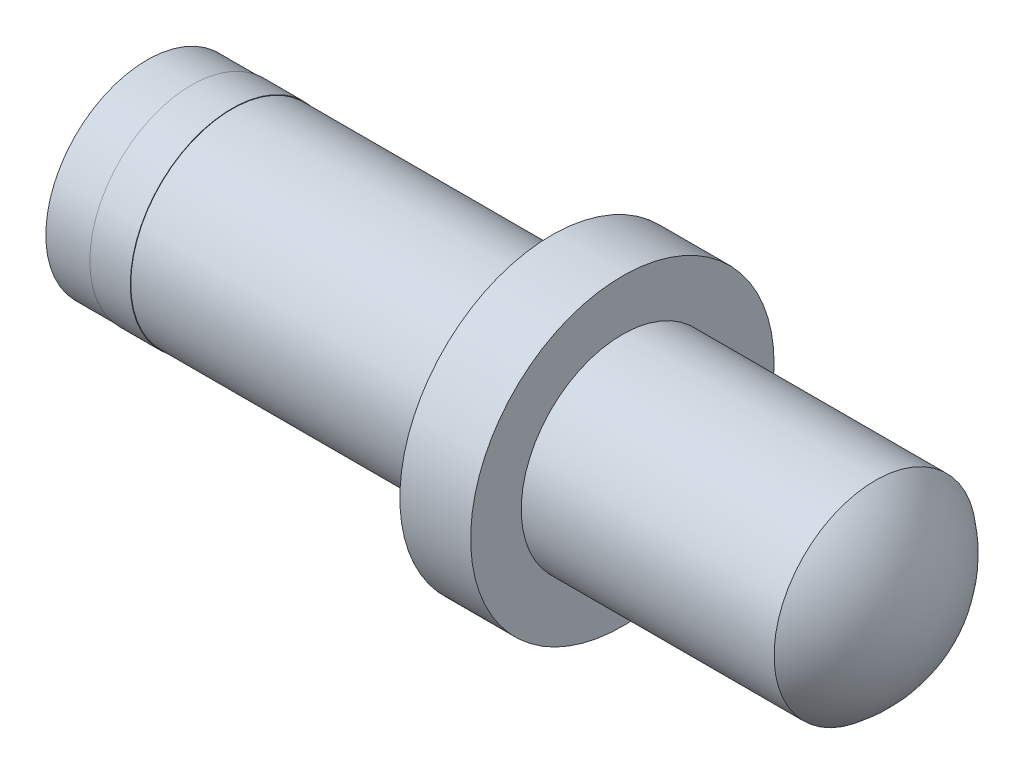
ISO-10303-21;
HEADER;
FILE_DESCRIPTION(('STEP AP214'),'2;1');
FILE_NAME('part.step','',(''),(''),'','','');
FILE_SCHEMA(('AUTOMOTIVE_DESIGN { 1 0 10303 214 1 1 1 1 }'));
ENDSEC;
DATA;
#1=APPLICATION_CONTEXT('core data for automotive mechanical design processes');
#2=APPLICATION_PROTOCOL_DEFINITION('international standard','automotive_design',2000,#1);
#3=PRODUCT_CONTEXT('',#1,'mechanical');
#4=PRODUCT('Part','Part','',(#3));
#5=PRODUCT_RELATED_PRODUCT_CATEGORY('part','',(#4));
#6=PRODUCT_DEFINITION_FORMATION('','',#4);
#7=PRODUCT_DEFINITION_CONTEXT('part definition',#1,'design');
#8=PRODUCT_DEFINITION('design','',#6,#7);
#9=PRODUCT_DEFINITION_SHAPE('','',#8);
#10=(LENGTH_UNIT() NAMED_UNIT(*) SI_UNIT(.MILLI.,.METRE.));
#11=(NAMED_UNIT(*) PLANE_ANGLE_UNIT() SI_UNIT($,.RADIAN.));
#12=(NAMED_UNIT(*) SI_UNIT($,.STERADIAN.) SOLID_ANGLE_UNIT());
#13=UNCERTAINTY_MEASURE_WITH_UNIT(LENGTH_MEASURE(1.E-05),#10,'distance_accuracy_value','');
#14=(GEOMETRIC_REPRESENTATION_CONTEXT(3) GLOBAL_UNCERTAINTY_ASSIGNED_CONTEXT((#13)) GLOBAL_UNIT_ASSIGNED_CONTEXT((#10,
#11,#12)) REPRESENTATION_CONTEXT('',''));
#15=CARTESIAN_POINT('',(0.,0.,0.));
#16=DIRECTION('',(0.,0.,1.));
#17=DIRECTION('',(1.,0.,0.));
#18=AXIS2_PLACEMENT_3D('',#15,#16,#17);
#19=CARTESIAN_POINT('',(14.4,0.,0.));
#20=DIRECTION('',(1.,0.,0.));
#21=DIRECTION('',(0.,0.,-1.));
#22=AXIS2_PLACEMENT_3D('',#19,#20,#21);
#23=CYLINDRICAL_SURFACE('',#22,2.);
#24=CARTESIAN_POINT('',(8.,0.,0.));
#25=DIRECTION('',(1.,0.,0.));
#26=DIRECTION('',(0.,0.,-1.));
#27=AXIS2_PLACEMENT_3D('',#24,#25,#26);
#28=CIRCLE('',#27,2.);
#29=CARTESIAN_POINT('',(8.,0.,-2.));
#30=VERTEX_POINT('',#29);
#31=EDGE_CURVE('E44',#30,#30,#28,.T.);
#32=ORIENTED_EDGE('',*,*,#31,.F.);
#33=EDGE_LOOP('',(#32));
#34=FACE_BOUND('',#33,.T.);
#35=CARTESIAN_POINT('',(1.68,0.,0.));
#36=DIRECTION('',(-1.,0.,0.));
#37=DIRECTION('',(0.,0.,1.));
#38=AXIS2_PLACEMENT_3D('',#35,#36,#37);
#39=CIRCLE('',#38,2.);
#40=CARTESIAN_POINT('',(1.68,0.,2.));
#41=VERTEX_POINT('',#40);
#42=EDGE_CURVE('E56',#41,#41,#39,.F.);
#43=ORIENTED_EDGE('',*,*,#42,.T.);
#44=EDGE_LOOP('',(#43));
#45=FACE_BOUND('',#44,.T.);
#46=ADVANCED_FACE('F33',(#34,#45),#23,.T.);
#47=CARTESIAN_POINT('',(8.,2.,0.));
#48=DIRECTION('',(-1.,0.,0.));
#49=DIRECTION('',(0.,0.,1.));
#50=AXIS2_PLACEMENT_3D('',#47,#48,#49);
#51=PLANE('',#50);
#52=ORIENTED_EDGE('',*,*,#31,.T.);
#53=EDGE_LOOP('',(#52));
#54=FACE_BOUND('',#53,.T.);
#55=CARTESIAN_POINT('',(8.,0.,0.));
#56=DIRECTION('',(1.,0.,0.));
#57=DIRECTION('',(0.,0.,-1.));
#58=AXIS2_PLACEMENT_3D('',#55,#56,#57);
#59=CIRCLE('',#58,3.);
#60=CARTESIAN_POINT('',(8.,0.,-3.));
#61=VERTEX_POINT('',#60);
#62=EDGE_CURVE('E49',#61,#61,#59,.T.);
#63=ORIENTED_EDGE('',*,*,#62,.F.);
#64=EDGE_LOOP('',(#63));
#65=FACE_BOUND('',#64,.T.);
#66=ADVANCED_FACE('F79',(#54,#65),#51,.T.);
#67=CARTESIAN_POINT('',(14.4,0.,0.));
#68=DIRECTION('',(1.,0.,0.));
#69=DIRECTION('',(0.,0.,-1.));
#70=AXIS2_PLACEMENT_3D('',#67,#68,#69);
#71=CYLINDRICAL_SURFACE('',#70,3.);
#72=ORIENTED_EDGE('',*,*,#62,.T.);
#73=EDGE_LOOP('',(#72));
#74=FACE_BOUND('',#73,.T.);
#75=CARTESIAN_POINT('',(9.4,0.,0.));
#76=DIRECTION('',(1.,0.,0.));
#77=DIRECTION('',(0.,0.,-1.));
#78=AXIS2_PLACEMENT_3D('',#75,#76,#77);
#79=CIRCLE('',#78,3.);
#80=CARTESIAN_POINT('',(9.4,0.,-3.));
#81=VERTEX_POINT('',#80);
#82=EDGE_CURVE('E71',#81,#81,#79,.T.);
#83=ORIENTED_EDGE('',*,*,#82,.F.);
#84=EDGE_LOOP('',(#83));
#85=FACE_BOUND('',#84,.T.);
#86=ADVANCED_FACE('F76',(#74,#85),#71,.T.);
#87=CARTESIAN_POINT('',(9.4,3.,0.));
#88=DIRECTION('',(1.,0.,0.));
#89=DIRECTION('',(0.,0.,-1.));
#90=AXIS2_PLACEMENT_3D('',#87,#88,#89);
#91=PLANE('',#90);
#92=ORIENTED_EDGE('',*,*,#82,.T.);
#93=EDGE_LOOP('',(#92));
#94=FACE_BOUND('',#93,.T.);
#95=CARTESIAN_POINT('',(9.4,0.,0.));
#96=DIRECTION('',(1.,0.,0.));
#97=DIRECTION('',(0.,0.,-1.));
#98=AXIS2_PLACEMENT_3D('',#95,#96,#97);
#99=CIRCLE('',#98,1.99999999999999);
#100=CARTESIAN_POINT('',(9.4,0.,-1.99999999999999));
#101=VERTEX_POINT('',#100);
#102=EDGE_CURVE('E55',#101,#101,#99,.T.);
#103=ORIENTED_EDGE('',*,*,#102,.F.);
#104=EDGE_LOOP('',(#103));
#105=FACE_BOUND('',#104,.T.);
#106=ADVANCED_FACE('F87',(#94,#105),#91,.T.);
#107=CARTESIAN_POINT('',(14.4,0.,0.));
#108=DIRECTION('',(1.,0.,0.));
#109=DIRECTION('',(0.,0.,-1.));
#110=AXIS2_PLACEMENT_3D('',#107,#108,#109);
#111=CYLINDRICAL_SURFACE('',#110,1.99999999999999);
#112=ORIENTED_EDGE('',*,*,#102,.T.);
#113=EDGE_LOOP('',(#112));
#114=FACE_BOUND('',#113,.T.);
#115=CARTESIAN_POINT('',(14.4,0.,0.));
#116=DIRECTION('',(1.,0.,0.));
#117=DIRECTION('',(0.,0.,-1.));
#118=AXIS2_PLACEMENT_3D('',#115,#116,#117);
#119=CIRCLE('',#118,1.99999999999999);
#120=CARTESIAN_POINT('',(14.4,0.,-1.99999999999999));
#121=VERTEX_POINT('',#120);
#122=EDGE_CURVE('E53',#121,#121,#119,.T.);
#123=ORIENTED_EDGE('',*,*,#122,.F.);
#124=EDGE_LOOP('',(#123));
#125=FACE_BOUND('',#124,.T.);
#126=ADVANCED_FACE('F115',(#114,#125),#111,.T.);
#127=CARTESIAN_POINT('',(12.9,0.,0.));
#128=DIRECTION('',(0.,0.,1.));
#129=DIRECTION('',(1.,0.,0.));
#130=AXIS2_PLACEMENT_3D('',#127,#128,#129);
#131=SPHERICAL_SURFACE('',#130,2.49999999999999);
#132=CARTESIAN_POINT('',(12.9,0.,0.));
#133=DIRECTION('',(1.,0.,0.));
#134=DIRECTION('',(0.,0.,-1.));
#135=AXIS2_PLACEMENT_3D('',#132,#133,#134);
#136=SPHERICAL_SURFACE('',#135,2.49999999999999);
#137=ORIENTED_EDGE('',*,*,#122,.T.);
#138=EDGE_LOOP('',(#137));
#139=FACE_BOUND('',#138,.T.);
#140=ADVANCED_FACE('F35',(#139),#136,.T.);
#141=CARTESIAN_POINT('',(0.88,0.,0.));
#142=DIRECTION('',(1.,0.,0.));
#143=DIRECTION('',(0.,0.,-1.));
#144=AXIS2_PLACEMENT_3D('',#141,#142,#143);
#145=CYLINDRICAL_SURFACE('',#144,2.01);
#146=CARTESIAN_POINT('',(0.88,0.,0.));
#147=DIRECTION('',(-1.,0.,0.));
#148=DIRECTION('',(0.,0.,1.));
#149=AXIS2_PLACEMENT_3D('',#146,#147,#148);
#150=CIRCLE('',#149,2.01);
#151=CARTESIAN_POINT('',(0.88,0.,2.01));
#152=VERTEX_POINT('',#151);
#153=EDGE_CURVE('E58',#152,#152,#150,.T.);
#154=ORIENTED_EDGE('',*,*,#153,.F.);
#155=EDGE_LOOP('',(#154));
#156=FACE_BOUND('',#155,.T.);
#157=CARTESIAN_POINT('',(1.68,0.,0.));
#158=DIRECTION('',(-1.,0.,0.));
#159=DIRECTION('',(0.,0.,1.));
#160=AXIS2_PLACEMENT_3D('',#157,#158,#159);
#161=CIRCLE('',#160,2.01);
#162=CARTESIAN_POINT('',(1.68,0.,2.01));
#163=VERTEX_POINT('',#162);
#164=EDGE_CURVE('E62',#163,#163,#161,.T.);
#165=ORIENTED_EDGE('',*,*,#164,.T.);
#166=EDGE_LOOP('',(#165));
#167=FACE_BOUND('',#166,.T.);
#168=ADVANCED_FACE('F108',(#156,#167),#145,.T.);
#169=CARTESIAN_POINT('',(0.88,0.,0.));
#170=DIRECTION('',(-1.,0.,0.));
#171=DIRECTION('',(0.,0.,1.));
#172=AXIS2_PLACEMENT_3D('',#169,#170,#171);
#173=PLANE('',#172);
#174=CARTESIAN_POINT('',(0.880000000000001,0.,0.));
#175=DIRECTION('',(-1.,0.,0.));
#176=DIRECTION('',(0.,0.,1.));
#177=AXIS2_PLACEMENT_3D('',#174,#175,#176);
#178=CIRCLE('',#177,2.);
#179=CARTESIAN_POINT('',(0.880000000000001,0.,2.));
#180=VERTEX_POINT('',#179);
#181=EDGE_CURVE('E10',#180,#180,#178,.F.);
#182=ORIENTED_EDGE('',*,*,#181,.T.);
#183=EDGE_LOOP('',(#182));
#184=FACE_BOUND('',#183,.T.);
#185=ORIENTED_EDGE('',*,*,#153,.T.);
#186=EDGE_LOOP('',(#185));
#187=FACE_BOUND('',#186,.T.);
#188=ADVANCED_FACE('F102',(#184,#187),#173,.T.);
#189=CARTESIAN_POINT('',(1.68,0.,0.));
#190=DIRECTION('',(-1.,0.,0.));
#191=DIRECTION('',(0.,0.,1.));
#192=AXIS2_PLACEMENT_3D('',#189,#190,#191);
#193=PLANE('',#192);
#194=ORIENTED_EDGE('',*,*,#42,.F.);
#195=EDGE_LOOP('',(#194));
#196=FACE_BOUND('',#195,.T.);
#197=ORIENTED_EDGE('',*,*,#164,.F.);
#198=EDGE_LOOP('',(#197));
#199=FACE_BOUND('',#198,.T.);
#200=ADVANCED_FACE('F97',(#196,#199),#193,.F.);
#201=CARTESIAN_POINT('',(0.,0.,0.));
#202=DIRECTION('',(-1.,0.,0.));
#203=DIRECTION('',(0.,0.,1.));
#204=AXIS2_PLACEMENT_3D('',#201,#202,#203);
#205=PLANE('',#204);
#206=CARTESIAN_POINT('',(0.,0.,0.));
#207=DIRECTION('',(1.,0.,0.));
#208=DIRECTION('',(0.,0.,-1.));
#209=AXIS2_PLACEMENT_3D('',#206,#207,#208);
#210=CIRCLE('',#209,2.);
#211=CARTESIAN_POINT('',(0.,0.,-2.));
#212=VERTEX_POINT('',#211);
#213=EDGE_CURVE('E40',#212,#212,#210,.T.);
#214=ORIENTED_EDGE('',*,*,#213,.F.);
#215=EDGE_LOOP('',(#214));
#216=FACE_BOUND('',#215,.T.);
#217=ADVANCED_FACE('F94',(#216),#205,.T.);
#218=ORIENTED_EDGE('',*,*,#181,.F.);
#219=EDGE_LOOP('',(#218));
#220=FACE_BOUND('',#219,.T.);
#221=ORIENTED_EDGE('',*,*,#213,.T.);
#222=EDGE_LOOP('',(#221));
#223=FACE_BOUND('',#222,.T.);
#224=ADVANCED_FACE('F91',(#220,#223),#23,.T.);
#225=CLOSED_SHELL('',(#46,#66,#86,#106,#126,#140,#168,#188,#200,#217,#224));
#226=MANIFOLD_SOLID_BREP('B2',#225);
#227=ADVANCED_BREP_SHAPE_REPRESENTATION('',(#18,#226),#14);
#228=SHAPE_DEFINITION_REPRESENTATION(#9,#227);
ENDSEC;
END-ISO-10303-21;
